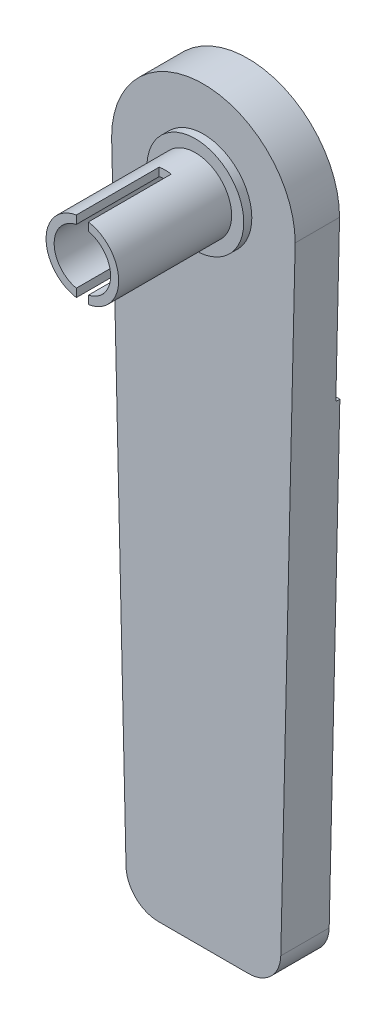
ISO-10303-21;
HEADER;
FILE_DESCRIPTION(('STEP AP214'),'2;1');
FILE_NAME('part.step','',(''),(''),'','','');
FILE_SCHEMA(('AUTOMOTIVE_DESIGN { 1 0 10303 214 1 1 1 1 }'));
ENDSEC;
DATA;
#1=APPLICATION_CONTEXT('core data for automotive mechanical design processes');
#2=APPLICATION_PROTOCOL_DEFINITION('international standard','automotive_design',2000,#1);
#3=PRODUCT_CONTEXT('',#1,'mechanical');
#4=PRODUCT('Part','Part','',(#3));
#5=PRODUCT_RELATED_PRODUCT_CATEGORY('part','',(#4));
#6=PRODUCT_DEFINITION_FORMATION('','',#4);
#7=PRODUCT_DEFINITION_CONTEXT('part definition',#1,'design');
#8=PRODUCT_DEFINITION('design','',#6,#7);
#9=PRODUCT_DEFINITION_SHAPE('','',#8);
#10=(LENGTH_UNIT() NAMED_UNIT(*) SI_UNIT(.MILLI.,.METRE.));
#11=(NAMED_UNIT(*) PLANE_ANGLE_UNIT() SI_UNIT($,.RADIAN.));
#12=(NAMED_UNIT(*) SI_UNIT($,.STERADIAN.) SOLID_ANGLE_UNIT());
#13=UNCERTAINTY_MEASURE_WITH_UNIT(LENGTH_MEASURE(1.E-05),#10,'distance_accuracy_value','');
#14=(GEOMETRIC_REPRESENTATION_CONTEXT(3) GLOBAL_UNCERTAINTY_ASSIGNED_CONTEXT((#13)) GLOBAL_UNIT_ASSIGNED_CONTEXT((#10,
#11,#12)) REPRESENTATION_CONTEXT('',''));
#15=CARTESIAN_POINT('',(0.,0.,0.));
#16=DIRECTION('',(0.,0.,1.));
#17=DIRECTION('',(1.,0.,0.));
#18=AXIS2_PLACEMENT_3D('',#15,#16,#17);
#19=CARTESIAN_POINT('',(0.,0.,6.));
#20=DIRECTION('',(0.,0.,-1.));
#21=DIRECTION('',(-1.,0.,0.));
#22=AXIS2_PLACEMENT_3D('',#19,#20,#21);
#23=CYLINDRICAL_SURFACE('',#22,11.375);
#24=CARTESIAN_POINT('',(0.,0.,0.5));
#25=DIRECTION('',(0.,0.,-1.));
#26=DIRECTION('',(-1.,0.,0.));
#27=AXIS2_PLACEMENT_3D('',#24,#25,#26);
#28=CIRCLE('',#27,11.375);
#29=CARTESIAN_POINT('',(-11.375,0.,0.5));
#30=VERTEX_POINT('',#29);
#31=CARTESIAN_POINT('',(11.375,0.,0.5));
#32=VERTEX_POINT('',#31);
#33=EDGE_CURVE('E148',#30,#32,#28,.T.);
#34=ORIENTED_EDGE('',*,*,#33,.F.);
#35=DIRECTION('',(0.,0.,-1.));
#36=VECTOR('',#35,1.);
#37=CARTESIAN_POINT('',(-11.375,0.,6.));
#38=LINE('',#37,#36);
#39=CARTESIAN_POINT('',(-11.375,0.,6.));
#40=VERTEX_POINT('',#39);
#41=EDGE_CURVE('E173',#40,#30,#38,.T.);
#42=ORIENTED_EDGE('',*,*,#41,.F.);
#43=CARTESIAN_POINT('',(0.,0.,6.));
#44=DIRECTION('',(0.,0.,1.));
#45=DIRECTION('',(1.,0.,0.));
#46=AXIS2_PLACEMENT_3D('',#43,#44,#45);
#47=CIRCLE('',#46,11.375);
#48=CARTESIAN_POINT('',(11.375,0.,6.));
#49=VERTEX_POINT('',#48);
#50=EDGE_CURVE('E170',#49,#40,#47,.T.);
#51=ORIENTED_EDGE('',*,*,#50,.F.);
#52=DIRECTION('',(0.,0.,-1.));
#53=VECTOR('',#52,1.);
#54=CARTESIAN_POINT('',(11.375,0.,6.));
#55=LINE('',#54,#53);
#56=EDGE_CURVE('E164',#49,#32,#55,.T.);
#57=ORIENTED_EDGE('',*,*,#56,.T.);
#58=EDGE_LOOP('',(#34,#42,#51,#57));
#59=FACE_BOUND('',#58,.T.);
#60=ADVANCED_FACE('F35',(#59),#23,.T.);
#61=CARTESIAN_POINT('',(0.,0.,21.));
#62=DIRECTION('',(0.,0.,1.));
#63=DIRECTION('',(1.,0.,0.));
#64=AXIS2_PLACEMENT_3D('',#61,#62,#63);
#65=PLANE('',#64);
#66=DIRECTION('',(0.,-1.,0.));
#67=VECTOR('',#66,1.);
#68=CARTESIAN_POINT('',(-0.75,11.375,21.));
#69=LINE('',#68,#67);
#70=CARTESIAN_POINT('',(-0.75,4.43705983732471,21.));
#71=VERTEX_POINT('',#70);
#72=CARTESIAN_POINT('',(-0.75,3.41869858279434,21.));
#73=VERTEX_POINT('',#72);
#74=EDGE_CURVE('E299',#71,#73,#69,.T.);
#75=ORIENTED_EDGE('',*,*,#74,.F.);
#76=CARTESIAN_POINT('',(0.,0.,21.));
#77=DIRECTION('',(0.,0.,1.));
#78=DIRECTION('',(1.,0.,0.));
#79=AXIS2_PLACEMENT_3D('',#76,#77,#78);
#80=CIRCLE('',#79,4.5);
#81=CARTESIAN_POINT('',(-0.75,-4.43705983732471,21.));
#82=VERTEX_POINT('',#81);
#83=EDGE_CURVE('E263',#71,#82,#80,.T.);
#84=ORIENTED_EDGE('',*,*,#83,.T.);
#85=CARTESIAN_POINT('',(-0.75,-3.41869858279434,21.));
#86=VERTEX_POINT('',#85);
#87=EDGE_CURVE('E298',#86,#82,#69,.T.);
#88=ORIENTED_EDGE('',*,*,#87,.F.);
#89=CARTESIAN_POINT('',(0.,0.,21.));
#90=DIRECTION('',(0.,0.,1.));
#91=DIRECTION('',(1.,0.,0.));
#92=AXIS2_PLACEMENT_3D('',#89,#90,#91);
#93=CIRCLE('',#92,3.5);
#94=EDGE_CURVE('E255',#73,#86,#93,.T.);
#95=ORIENTED_EDGE('',*,*,#94,.F.);
#96=EDGE_LOOP('',(#75,#84,#88,#95));
#97=FACE_BOUND('',#96,.T.);
#98=ADVANCED_FACE('F334',(#97),#65,.T.);
#99=CARTESIAN_POINT('',(11.368956688057,-0.26211858333977,6.));
#100=DIRECTION('',(0.999734324622892,-0.0230495156307152,0.));
#101=DIRECTION('',(0.0230495156307152,0.999734324622892,0.));
#102=AXIS2_PLACEMENT_3D('',#99,#100,#101);
#103=PLANE('',#102);
#104=DIRECTION('',(0.,0.,-1.));
#105=VECTOR('',#104,1.);
#106=CARTESIAN_POINT('',(10.9138871810636,-20.,0.5));
#107=LINE('',#106,#105);
#108=CARTESIAN_POINT('',(10.9138871810636,-20.,0.5));
#109=VERTEX_POINT('',#108);
#110=CARTESIAN_POINT('',(10.9138871810636,-20.,0.));
#111=VERTEX_POINT('',#110);
#112=EDGE_CURVE('E50',#109,#111,#107,.T.);
#113=ORIENTED_EDGE('',*,*,#112,.F.);
#114=DIRECTION('',(-0.0230495156307152,-0.999734324622892,0.));
#115=VECTOR('',#114,1.);
#116=CARTESIAN_POINT('',(11.375,0.,0.5));
#117=LINE('',#116,#115);
#118=EDGE_CURVE('E152',#32,#109,#117,.T.);
#119=ORIENTED_EDGE('',*,*,#118,.F.);
#120=ORIENTED_EDGE('',*,*,#56,.F.);
#121=DIRECTION('',(-0.0230495156307152,-0.999734324622892,0.));
#122=VECTOR('',#121,1.);
#123=CARTESIAN_POINT('',(11.368956688057,-0.26211858333977,6.));
#124=LINE('',#123,#122);
#125=CARTESIAN_POINT('',(9.59009687836176,-77.4171980625229,6.));
#126=VERTEX_POINT('',#125);
#127=EDGE_CURVE('E264',#49,#126,#124,.T.);
#128=ORIENTED_EDGE('',*,*,#127,.T.);
#129=DIRECTION('',(0.,0.,-1.));
#130=VECTOR('',#129,1.);
#131=CARTESIAN_POINT('',(9.59009687836176,-77.4171980625229,0.));
#132=LINE('',#131,#130);
#133=CARTESIAN_POINT('',(9.59009687836176,-77.4171980625229,0.));
#134=VERTEX_POINT('',#133);
#135=EDGE_CURVE('E172',#126,#134,#132,.T.);
#136=ORIENTED_EDGE('',*,*,#135,.T.);
#137=DIRECTION('',(-0.0230495156307152,-0.999734324622892,0.));
#138=VECTOR('',#137,1.);
#139=CARTESIAN_POINT('',(11.368956688057,-0.26211858333977,0.));
#140=LINE('',#139,#138);
#141=EDGE_CURVE('E272',#111,#134,#140,.T.);
#142=ORIENTED_EDGE('',*,*,#141,.F.);
#143=EDGE_LOOP('',(#113,#119,#120,#128,#136,#142));
#144=FACE_BOUND('',#143,.T.);
#145=ADVANCED_FACE('F162',(#144),#103,.T.);
#146=CARTESIAN_POINT('',(-11.368956688057,-0.262118583339774,6.));
#147=DIRECTION('',(-0.999734324622892,-0.0230495156307155,0.));
#148=DIRECTION('',(0.0230495156307155,-0.999734324622892,0.));
#149=AXIS2_PLACEMENT_3D('',#146,#147,#148);
#150=PLANE('',#149);
#151=DIRECTION('',(0.,0.,-1.));
#152=VECTOR('',#151,1.);
#153=CARTESIAN_POINT('',(-10.9138871810636,-20.,0.5));
#154=LINE('',#153,#152);
#155=CARTESIAN_POINT('',(-10.9138871810636,-20.,0.5));
#156=VERTEX_POINT('',#155);
#157=CARTESIAN_POINT('',(-10.9138871810636,-20.,0.));
#158=VERTEX_POINT('',#157);
#159=EDGE_CURVE('E229',#156,#158,#154,.T.);
#160=ORIENTED_EDGE('',*,*,#159,.T.);
#161=DIRECTION('',(-0.0230495156307155,0.999734324622892,0.));
#162=VECTOR('',#161,1.);
#163=CARTESIAN_POINT('',(-11.368956688057,-0.262118583339774,0.));
#164=LINE('',#163,#162);
#165=CARTESIAN_POINT('',(-9.59009687836174,-77.4171980625229,0.));
#166=VERTEX_POINT('',#165);
#167=EDGE_CURVE('E274',#166,#158,#164,.T.);
#168=ORIENTED_EDGE('',*,*,#167,.F.);
#169=DIRECTION('',(0.,0.,-1.));
#170=VECTOR('',#169,1.);
#171=CARTESIAN_POINT('',(-9.59009687836174,-77.4171980625229,6.));
#172=LINE('',#171,#170);
#173=CARTESIAN_POINT('',(-9.59009687836174,-77.4171980625229,6.));
#174=VERTEX_POINT('',#173);
#175=EDGE_CURVE('E194',#166,#174,#172,.F.);
#176=ORIENTED_EDGE('',*,*,#175,.T.);
#177=DIRECTION('',(-0.0230495156307155,0.999734324622892,0.));
#178=VECTOR('',#177,1.);
#179=CARTESIAN_POINT('',(-11.368956688057,-0.262118583339774,6.));
#180=LINE('',#179,#178);
#181=EDGE_CURVE('E268',#174,#40,#180,.T.);
#182=ORIENTED_EDGE('',*,*,#181,.T.);
#183=ORIENTED_EDGE('',*,*,#41,.T.);
#184=DIRECTION('',(-0.0230495156307155,0.999734324622892,0.));
#185=VECTOR('',#184,1.);
#186=CARTESIAN_POINT('',(-10.9138871810636,-20.,0.5));
#187=LINE('',#186,#185);
#188=EDGE_CURVE('E154',#156,#30,#187,.T.);
#189=ORIENTED_EDGE('',*,*,#188,.F.);
#190=EDGE_LOOP('',(#160,#168,#176,#182,#183,#189));
#191=FACE_BOUND('',#190,.T.);
#192=ADVANCED_FACE('F343',(#191),#150,.T.);
#193=CARTESIAN_POINT('',(0.,-81.325,6.));
#194=DIRECTION('',(0.,1.,0.));
#195=DIRECTION('',(0.,0.,1.));
#196=AXIS2_PLACEMENT_3D('',#193,#194,#195);
#197=PLANE('',#196);
#198=DIRECTION('',(1.,0.,0.));
#199=VECTOR('',#198,1.);
#200=CARTESIAN_POINT('',(0.,-81.325,0.));
#201=LINE('',#200,#199);
#202=CARTESIAN_POINT('',(-5.59115957987017,-81.325,0.));
#203=VERTEX_POINT('',#202);
#204=CARTESIAN_POINT('',(5.5911595798702,-81.325,0.));
#205=VERTEX_POINT('',#204);
#206=EDGE_CURVE('E266',#203,#205,#201,.T.);
#207=ORIENTED_EDGE('',*,*,#206,.T.);
#208=DIRECTION('',(0.,0.,-1.));
#209=VECTOR('',#208,1.);
#210=CARTESIAN_POINT('',(5.5911595798702,-81.325,6.));
#211=LINE('',#210,#209);
#212=CARTESIAN_POINT('',(5.5911595798702,-81.325,6.));
#213=VERTEX_POINT('',#212);
#214=EDGE_CURVE('E188',#205,#213,#211,.F.);
#215=ORIENTED_EDGE('',*,*,#214,.T.);
#216=DIRECTION('',(1.,0.,0.));
#217=VECTOR('',#216,1.);
#218=CARTESIAN_POINT('',(0.,-81.325,6.));
#219=LINE('',#218,#217);
#220=CARTESIAN_POINT('',(-5.59115957987017,-81.325,6.));
#221=VERTEX_POINT('',#220);
#222=EDGE_CURVE('E178',#221,#213,#219,.T.);
#223=ORIENTED_EDGE('',*,*,#222,.F.);
#224=DIRECTION('',(0.,0.,-1.));
#225=VECTOR('',#224,1.);
#226=CARTESIAN_POINT('',(-5.59115957987017,-81.325,0.));
#227=LINE('',#226,#225);
#228=EDGE_CURVE('E185',#221,#203,#227,.T.);
#229=ORIENTED_EDGE('',*,*,#228,.T.);
#230=EDGE_LOOP('',(#207,#215,#223,#229));
#231=FACE_BOUND('',#230,.T.);
#232=ADVANCED_FACE('F280',(#231),#197,.F.);
#233=CARTESIAN_POINT('',(0.,0.,6.));
#234=DIRECTION('',(0.,0.,1.));
#235=DIRECTION('',(1.,0.,0.));
#236=AXIS2_PLACEMENT_3D('',#233,#234,#235);
#237=PLANE('',#236);
#238=CARTESIAN_POINT('',(0.,0.,6.));
#239=DIRECTION('',(0.,0.,1.));
#240=DIRECTION('',(1.,0.,0.));
#241=AXIS2_PLACEMENT_3D('',#238,#239,#240);
#242=CIRCLE('',#241,6.);
#243=CARTESIAN_POINT('',(6.,0.,6.));
#244=VERTEX_POINT('',#243);
#245=EDGE_CURVE('E254',#244,#244,#242,.T.);
#246=ORIENTED_EDGE('',*,*,#245,.F.);
#247=EDGE_LOOP('',(#246));
#248=FACE_BOUND('',#247,.T.);
#249=ORIENTED_EDGE('',*,*,#222,.T.);
#250=CARTESIAN_POINT('',(5.5911595798702,-77.325,6.));
#251=DIRECTION('',(0.,0.,1.));
#252=DIRECTION('',(1.,0.,0.));
#253=AXIS2_PLACEMENT_3D('',#250,#251,#252);
#254=CIRCLE('',#253,4.);
#255=EDGE_CURVE('E192',#213,#126,#254,.T.);
#256=ORIENTED_EDGE('',*,*,#255,.T.);
#257=ORIENTED_EDGE('',*,*,#127,.F.);
#258=ORIENTED_EDGE('',*,*,#50,.T.);
#259=ORIENTED_EDGE('',*,*,#181,.F.);
#260=CARTESIAN_POINT('',(-5.59115957987017,-77.325,6.));
#261=DIRECTION('',(0.,0.,1.));
#262=DIRECTION('',(1.,0.,0.));
#263=AXIS2_PLACEMENT_3D('',#260,#261,#262);
#264=CIRCLE('',#263,4.);
#265=EDGE_CURVE('E190',#174,#221,#264,.T.);
#266=ORIENTED_EDGE('',*,*,#265,.T.);
#267=EDGE_LOOP('',(#249,#256,#257,#258,#259,#266));
#268=FACE_BOUND('',#267,.T.);
#269=ADVANCED_FACE('F290',(#248,#268),#237,.T.);
#270=CARTESIAN_POINT('',(0.,0.,0.));
#271=DIRECTION('',(0.,0.,1.));
#272=DIRECTION('',(1.,0.,0.));
#273=AXIS2_PLACEMENT_3D('',#270,#271,#272);
#274=PLANE('',#273);
#275=ORIENTED_EDGE('',*,*,#167,.T.);
#276=DIRECTION('',(-1.,0.,0.));
#277=VECTOR('',#276,1.);
#278=CARTESIAN_POINT('',(10.9138871810636,-20.,0.));
#279=LINE('',#278,#277);
#280=EDGE_CURVE('E159',#111,#158,#279,.T.);
#281=ORIENTED_EDGE('',*,*,#280,.F.);
#282=ORIENTED_EDGE('',*,*,#141,.T.);
#283=CARTESIAN_POINT('',(5.5911595798702,-77.325,0.));
#284=DIRECTION('',(0.,0.,1.));
#285=DIRECTION('',(1.,0.,0.));
#286=AXIS2_PLACEMENT_3D('',#283,#284,#285);
#287=CIRCLE('',#286,4.);
#288=EDGE_CURVE('E183',#134,#205,#287,.F.);
#289=ORIENTED_EDGE('',*,*,#288,.T.);
#290=ORIENTED_EDGE('',*,*,#206,.F.);
#291=CARTESIAN_POINT('',(-5.59115957987017,-77.325,0.));
#292=DIRECTION('',(0.,0.,1.));
#293=DIRECTION('',(1.,0.,0.));
#294=AXIS2_PLACEMENT_3D('',#291,#292,#293);
#295=CIRCLE('',#294,4.);
#296=EDGE_CURVE('E176',#203,#166,#295,.F.);
#297=ORIENTED_EDGE('',*,*,#296,.T.);
#298=EDGE_LOOP('',(#275,#281,#282,#289,#290,#297));
#299=FACE_BOUND('',#298,.T.);
#300=ADVANCED_FACE('F291',(#299),#274,.F.);
#301=CARTESIAN_POINT('',(5.5911595798702,-77.325,6.));
#302=DIRECTION('',(0.,0.,1.));
#303=DIRECTION('',(1.,0.,0.));
#304=AXIS2_PLACEMENT_3D('',#301,#302,#303);
#305=CYLINDRICAL_SURFACE('',#304,4.);
#306=ORIENTED_EDGE('',*,*,#255,.F.);
#307=ORIENTED_EDGE('',*,*,#214,.F.);
#308=ORIENTED_EDGE('',*,*,#288,.F.);
#309=ORIENTED_EDGE('',*,*,#135,.F.);
#310=EDGE_LOOP('',(#306,#307,#308,#309));
#311=FACE_BOUND('',#310,.T.);
#312=ADVANCED_FACE('F287',(#311),#305,.T.);
#313=CARTESIAN_POINT('',(-5.59115957987017,-77.325,6.));
#314=DIRECTION('',(0.,0.,1.));
#315=DIRECTION('',(1.,0.,0.));
#316=AXIS2_PLACEMENT_3D('',#313,#314,#315);
#317=CYLINDRICAL_SURFACE('',#316,4.);
#318=ORIENTED_EDGE('',*,*,#265,.F.);
#319=ORIENTED_EDGE('',*,*,#175,.F.);
#320=ORIENTED_EDGE('',*,*,#296,.F.);
#321=ORIENTED_EDGE('',*,*,#228,.F.);
#322=EDGE_LOOP('',(#318,#319,#320,#321));
#323=FACE_BOUND('',#322,.T.);
#324=ADVANCED_FACE('F37',(#323),#317,.T.);
#325=CARTESIAN_POINT('',(0.,0.,7.));
#326=DIRECTION('',(0.,0.,-1.));
#327=DIRECTION('',(-1.,0.,0.));
#328=AXIS2_PLACEMENT_3D('',#325,#326,#327);
#329=CYLINDRICAL_SURFACE('',#328,6.);
#330=CARTESIAN_POINT('',(0.,0.,7.));
#331=DIRECTION('',(0.,0.,1.));
#332=DIRECTION('',(1.,0.,0.));
#333=AXIS2_PLACEMENT_3D('',#330,#331,#332);
#334=CIRCLE('',#333,6.);
#335=CARTESIAN_POINT('',(6.,0.,7.));
#336=VERTEX_POINT('',#335);
#337=EDGE_CURVE('E201',#336,#336,#334,.T.);
#338=ORIENTED_EDGE('',*,*,#337,.F.);
#339=EDGE_LOOP('',(#338));
#340=FACE_BOUND('',#339,.T.);
#341=ORIENTED_EDGE('',*,*,#245,.T.);
#342=EDGE_LOOP('',(#341));
#343=FACE_BOUND('',#342,.T.);
#344=ADVANCED_FACE('F351',(#340,#343),#329,.T.);
#345=CARTESIAN_POINT('',(0.,0.,7.));
#346=DIRECTION('',(0.,0.,1.));
#347=DIRECTION('',(1.,0.,0.));
#348=AXIS2_PLACEMENT_3D('',#345,#346,#347);
#349=PLANE('',#348);
#350=CARTESIAN_POINT('',(0.,0.,7.));
#351=DIRECTION('',(0.,0.,1.));
#352=DIRECTION('',(1.,0.,0.));
#353=AXIS2_PLACEMENT_3D('',#350,#351,#352);
#354=CIRCLE('',#353,4.5);
#355=CARTESIAN_POINT('',(4.5,0.,7.));
#356=VERTEX_POINT('',#355);
#357=EDGE_CURVE('E197',#356,#356,#354,.T.);
#358=ORIENTED_EDGE('',*,*,#357,.F.);
#359=EDGE_LOOP('',(#358));
#360=FACE_BOUND('',#359,.T.);
#361=ORIENTED_EDGE('',*,*,#337,.T.);
#362=EDGE_LOOP('',(#361));
#363=FACE_BOUND('',#362,.T.);
#364=ADVANCED_FACE('F383',(#360,#363),#349,.T.);
#365=DIRECTION('',(0.,-1.,0.));
#366=VECTOR('',#365,1.);
#367=CARTESIAN_POINT('',(0.75,11.375,21.));
#368=LINE('',#367,#366);
#369=CARTESIAN_POINT('',(0.75,-3.41869858279434,21.));
#370=VERTEX_POINT('',#369);
#371=CARTESIAN_POINT('',(0.75,-4.43705983732471,21.));
#372=VERTEX_POINT('',#371);
#373=EDGE_CURVE('E301',#370,#372,#368,.T.);
#374=ORIENTED_EDGE('',*,*,#373,.T.);
#375=CARTESIAN_POINT('',(0.75,4.43705983732471,21.));
#376=VERTEX_POINT('',#375);
#377=EDGE_CURVE('E200',#372,#376,#80,.T.);
#378=ORIENTED_EDGE('',*,*,#377,.T.);
#379=CARTESIAN_POINT('',(0.75,3.41869858279434,21.));
#380=VERTEX_POINT('',#379);
#381=EDGE_CURVE('E300',#376,#380,#368,.T.);
#382=ORIENTED_EDGE('',*,*,#381,.T.);
#383=EDGE_CURVE('E250',#370,#380,#93,.T.);
#384=ORIENTED_EDGE('',*,*,#383,.F.);
#385=EDGE_LOOP('',(#374,#378,#382,#384));
#386=FACE_BOUND('',#385,.T.);
#387=ADVANCED_FACE('F316',(#386),#65,.T.);
#388=CARTESIAN_POINT('',(0.,0.,21.));
#389=DIRECTION('',(0.,0.,-1.));
#390=DIRECTION('',(-1.,0.,0.));
#391=AXIS2_PLACEMENT_3D('',#388,#389,#390);
#392=CYLINDRICAL_SURFACE('',#391,4.5);
#393=ORIENTED_EDGE('',*,*,#83,.F.);
#394=DIRECTION('',(0.,0.,-1.));
#395=VECTOR('',#394,1.);
#396=CARTESIAN_POINT('',(-0.75,4.43705983732471,21.));
#397=LINE('',#396,#395);
#398=CARTESIAN_POINT('',(-0.75,4.43705983732471,10.7337457596543));
#399=VERTEX_POINT('',#398);
#400=EDGE_CURVE('E247',#71,#399,#397,.T.);
#401=ORIENTED_EDGE('',*,*,#400,.T.);
#402=CARTESIAN_POINT('',(0.,0.,10.7337457596543));
#403=DIRECTION('',(0.,0.,-1.));
#404=DIRECTION('',(-1.,0.,0.));
#405=AXIS2_PLACEMENT_3D('',#402,#403,#404);
#406=CIRCLE('',#405,4.5);
#407=CARTESIAN_POINT('',(0.75,4.43705983732471,10.7337457596543));
#408=VERTEX_POINT('',#407);
#409=EDGE_CURVE('E236',#399,#408,#406,.T.);
#410=ORIENTED_EDGE('',*,*,#409,.T.);
#411=DIRECTION('',(0.,0.,-1.));
#412=VECTOR('',#411,1.);
#413=CARTESIAN_POINT('',(0.75,4.43705983732471,21.));
#414=LINE('',#413,#412);
#415=EDGE_CURVE('E239',#408,#376,#414,.F.);
#416=ORIENTED_EDGE('',*,*,#415,.T.);
#417=ORIENTED_EDGE('',*,*,#377,.F.);
#418=DIRECTION('',(0.,0.,-1.));
#419=VECTOR('',#418,1.);
#420=CARTESIAN_POINT('',(0.75,-4.43705983732471,21.));
#421=LINE('',#420,#419);
#422=CARTESIAN_POINT('',(0.75,-4.43705983732471,10.7337457596543));
#423=VERTEX_POINT('',#422);
#424=EDGE_CURVE('E243',#372,#423,#421,.T.);
#425=ORIENTED_EDGE('',*,*,#424,.T.);
#426=CARTESIAN_POINT('',(-0.75,-4.43705983732471,10.7337457596543));
#427=VERTEX_POINT('',#426);
#428=EDGE_CURVE('E240',#423,#427,#406,.T.);
#429=ORIENTED_EDGE('',*,*,#428,.T.);
#430=DIRECTION('',(0.,0.,-1.));
#431=VECTOR('',#430,1.);
#432=CARTESIAN_POINT('',(-0.75,-4.43705983732471,21.));
#433=LINE('',#432,#431);
#434=EDGE_CURVE('E227',#427,#82,#433,.F.);
#435=ORIENTED_EDGE('',*,*,#434,.T.);
#436=EDGE_LOOP('',(#393,#401,#410,#416,#417,#425,#429,#435));
#437=FACE_BOUND('',#436,.T.);
#438=ORIENTED_EDGE('',*,*,#357,.T.);
#439=EDGE_LOOP('',(#438));
#440=FACE_BOUND('',#439,.T.);
#441=ADVANCED_FACE('F314',(#437,#440),#392,.T.);
#442=CARTESIAN_POINT('',(0.,0.,6.));
#443=DIRECTION('',(0.,0.,1.));
#444=DIRECTION('',(1.,0.,0.));
#445=AXIS2_PLACEMENT_3D('',#442,#443,#444);
#446=CYLINDRICAL_SURFACE('',#445,3.5);
#447=ORIENTED_EDGE('',*,*,#94,.T.);
#448=DIRECTION('',(0.,0.,1.));
#449=VECTOR('',#448,1.);
#450=CARTESIAN_POINT('',(-0.75,-3.41869858279434,6.));
#451=LINE('',#450,#449);
#452=CARTESIAN_POINT('',(-0.75,-3.41869858279434,10.7337457596543));
#453=VERTEX_POINT('',#452);
#454=EDGE_CURVE('E11',#86,#453,#451,.F.);
#455=ORIENTED_EDGE('',*,*,#454,.T.);
#456=CARTESIAN_POINT('',(0.,0.,10.7337457596543));
#457=DIRECTION('',(0.,0.,-1.));
#458=DIRECTION('',(-1.,0.,0.));
#459=AXIS2_PLACEMENT_3D('',#456,#457,#458);
#460=CIRCLE('',#459,3.5);
#461=CARTESIAN_POINT('',(0.75,-3.41869858279434,10.7337457596543));
#462=VERTEX_POINT('',#461);
#463=EDGE_CURVE('E205',#453,#462,#460,.F.);
#464=ORIENTED_EDGE('',*,*,#463,.T.);
#465=DIRECTION('',(0.,0.,1.));
#466=VECTOR('',#465,1.);
#467=CARTESIAN_POINT('',(0.75,-3.41869858279434,6.));
#468=LINE('',#467,#466);
#469=EDGE_CURVE('E43',#462,#370,#468,.T.);
#470=ORIENTED_EDGE('',*,*,#469,.T.);
#471=ORIENTED_EDGE('',*,*,#383,.T.);
#472=DIRECTION('',(0.,0.,1.));
#473=VECTOR('',#472,1.);
#474=CARTESIAN_POINT('',(0.75,3.41869858279434,6.));
#475=LINE('',#474,#473);
#476=CARTESIAN_POINT('',(0.75,3.41869858279434,10.7337457596543));
#477=VERTEX_POINT('',#476);
#478=EDGE_CURVE('E204',#380,#477,#475,.F.);
#479=ORIENTED_EDGE('',*,*,#478,.T.);
#480=CARTESIAN_POINT('',(-0.75,3.41869858279434,10.7337457596543));
#481=VERTEX_POINT('',#480);
#482=EDGE_CURVE('E196',#477,#481,#460,.F.);
#483=ORIENTED_EDGE('',*,*,#482,.T.);
#484=DIRECTION('',(0.,0.,1.));
#485=VECTOR('',#484,1.);
#486=CARTESIAN_POINT('',(-0.75,3.41869858279434,6.));
#487=LINE('',#486,#485);
#488=EDGE_CURVE('E208',#481,#73,#487,.T.);
#489=ORIENTED_EDGE('',*,*,#488,.T.);
#490=EDGE_LOOP('',(#447,#455,#464,#470,#471,#479,#483,#489));
#491=FACE_BOUND('',#490,.T.);
#492=CARTESIAN_POINT('',(0.,0.,6.));
#493=DIRECTION('',(0.,0.,1.));
#494=DIRECTION('',(1.,0.,0.));
#495=AXIS2_PLACEMENT_3D('',#492,#493,#494);
#496=CIRCLE('',#495,3.5);
#497=CARTESIAN_POINT('',(3.5,0.,6.));
#498=VERTEX_POINT('',#497);
#499=EDGE_CURVE('E251',#498,#498,#496,.T.);
#500=ORIENTED_EDGE('',*,*,#499,.F.);
#501=EDGE_LOOP('',(#500));
#502=FACE_BOUND('',#501,.T.);
#503=ADVANCED_FACE('F216',(#491,#502),#446,.F.);
#504=CARTESIAN_POINT('',(0.,0.,6.));
#505=DIRECTION('',(0.,0.,1.));
#506=DIRECTION('',(1.,0.,0.));
#507=AXIS2_PLACEMENT_3D('',#504,#505,#506);
#508=PLANE('',#507);
#509=ORIENTED_EDGE('',*,*,#499,.T.);
#510=EDGE_LOOP('',(#509));
#511=FACE_BOUND('',#510,.T.);
#512=ADVANCED_FACE('F328',(#511),#508,.T.);
#513=CARTESIAN_POINT('',(-0.75,11.375,10.7337457596543));
#514=DIRECTION('',(0.,0.,-1.));
#515=DIRECTION('',(-1.,0.,0.));
#516=AXIS2_PLACEMENT_3D('',#513,#514,#515);
#517=PLANE('',#516);
#518=DIRECTION('',(0.,-1.,0.));
#519=VECTOR('',#518,1.);
#520=CARTESIAN_POINT('',(-0.75,11.375,10.7337457596543));
#521=LINE('',#520,#519);
#522=EDGE_CURVE('E228',#399,#481,#521,.T.);
#523=ORIENTED_EDGE('',*,*,#522,.T.);
#524=ORIENTED_EDGE('',*,*,#482,.F.);
#525=DIRECTION('',(0.,-1.,0.));
#526=VECTOR('',#525,1.);
#527=CARTESIAN_POINT('',(0.75,11.375,10.7337457596543));
#528=LINE('',#527,#526);
#529=EDGE_CURVE('E303',#408,#477,#528,.T.);
#530=ORIENTED_EDGE('',*,*,#529,.F.);
#531=ORIENTED_EDGE('',*,*,#409,.F.);
#532=EDGE_LOOP('',(#523,#524,#530,#531));
#533=FACE_BOUND('',#532,.T.);
#534=ADVANCED_FACE('F320',(#533),#517,.F.);
#535=CARTESIAN_POINT('',(0.75,11.375,21.));
#536=DIRECTION('',(1.,0.,0.));
#537=DIRECTION('',(0.,0.,-1.));
#538=AXIS2_PLACEMENT_3D('',#535,#536,#537);
#539=PLANE('',#538);
#540=ORIENTED_EDGE('',*,*,#529,.T.);
#541=ORIENTED_EDGE('',*,*,#478,.F.);
#542=ORIENTED_EDGE('',*,*,#381,.F.);
#543=ORIENTED_EDGE('',*,*,#415,.F.);
#544=EDGE_LOOP('',(#540,#541,#542,#543));
#545=FACE_BOUND('',#544,.T.);
#546=ADVANCED_FACE('F317',(#545),#539,.F.);
#547=CARTESIAN_POINT('',(-0.75,11.375,21.));
#548=DIRECTION('',(-1.,0.,0.));
#549=DIRECTION('',(0.,0.,1.));
#550=AXIS2_PLACEMENT_3D('',#547,#548,#549);
#551=PLANE('',#550);
#552=ORIENTED_EDGE('',*,*,#74,.T.);
#553=ORIENTED_EDGE('',*,*,#488,.F.);
#554=ORIENTED_EDGE('',*,*,#522,.F.);
#555=ORIENTED_EDGE('',*,*,#400,.F.);
#556=EDGE_LOOP('',(#552,#553,#554,#555));
#557=FACE_BOUND('',#556,.T.);
#558=ADVANCED_FACE('F319',(#557),#551,.F.);
#559=EDGE_CURVE('E221',#453,#427,#521,.T.);
#560=ORIENTED_EDGE('',*,*,#559,.F.);
#561=ORIENTED_EDGE('',*,*,#454,.F.);
#562=ORIENTED_EDGE('',*,*,#87,.T.);
#563=ORIENTED_EDGE('',*,*,#434,.F.);
#564=EDGE_LOOP('',(#560,#561,#562,#563));
#565=FACE_BOUND('',#564,.T.);
#566=ADVANCED_FACE('F224',(#565),#551,.F.);
#567=ORIENTED_EDGE('',*,*,#373,.F.);
#568=ORIENTED_EDGE('',*,*,#469,.F.);
#569=EDGE_CURVE('E58',#462,#423,#528,.T.);
#570=ORIENTED_EDGE('',*,*,#569,.T.);
#571=ORIENTED_EDGE('',*,*,#424,.F.);
#572=EDGE_LOOP('',(#567,#568,#570,#571));
#573=FACE_BOUND('',#572,.T.);
#574=ADVANCED_FACE('F311',(#573),#539,.F.);
#575=ORIENTED_EDGE('',*,*,#569,.F.);
#576=ORIENTED_EDGE('',*,*,#463,.F.);
#577=ORIENTED_EDGE('',*,*,#559,.T.);
#578=ORIENTED_EDGE('',*,*,#428,.F.);
#579=EDGE_LOOP('',(#575,#576,#577,#578));
#580=FACE_BOUND('',#579,.T.);
#581=ADVANCED_FACE('F220',(#580),#517,.F.);
#582=CARTESIAN_POINT('',(10.9138871810636,-20.,0.5));
#583=DIRECTION('',(0.,-1.,0.));
#584=DIRECTION('',(0.,0.,-1.));
#585=AXIS2_PLACEMENT_3D('',#582,#583,#584);
#586=PLANE('',#585);
#587=ORIENTED_EDGE('',*,*,#280,.T.);
#588=ORIENTED_EDGE('',*,*,#159,.F.);
#589=DIRECTION('',(-1.,0.,0.));
#590=VECTOR('',#589,1.);
#591=CARTESIAN_POINT('',(10.9138871810636,-20.,0.5));
#592=LINE('',#591,#590);
#593=EDGE_CURVE('E167',#109,#156,#592,.T.);
#594=ORIENTED_EDGE('',*,*,#593,.F.);
#595=ORIENTED_EDGE('',*,*,#112,.T.);
#596=EDGE_LOOP('',(#587,#588,#594,#595));
#597=FACE_BOUND('',#596,.T.);
#598=ADVANCED_FACE('F368',(#597),#586,.F.);
#599=CARTESIAN_POINT('',(0.,0.,0.5));
#600=DIRECTION('',(0.,0.,-1.));
#601=DIRECTION('',(-1.,0.,0.));
#602=AXIS2_PLACEMENT_3D('',#599,#600,#601);
#603=PLANE('',#602);
#604=ORIENTED_EDGE('',*,*,#33,.T.);
#605=ORIENTED_EDGE('',*,*,#118,.T.);
#606=ORIENTED_EDGE('',*,*,#593,.T.);
#607=ORIENTED_EDGE('',*,*,#188,.T.);
#608=EDGE_LOOP('',(#604,#605,#606,#607));
#609=FACE_BOUND('',#608,.T.);
#610=ADVANCED_FACE('F150',(#609),#603,.T.);
#611=CLOSED_SHELL('',(#60,#98,#145,#192,#232,#269,#300,#312,#324,#344,#364,#387,#441,#503,#512,
#534,#546,#558,#566,#574,#581,#598,#610));
#612=MANIFOLD_SOLID_BREP('B2',#611);
#613=ADVANCED_BREP_SHAPE_REPRESENTATION('',(#18,#612),#14);
#614=SHAPE_DEFINITION_REPRESENTATION(#9,#613);
ENDSEC;
END-ISO-10303-21;
